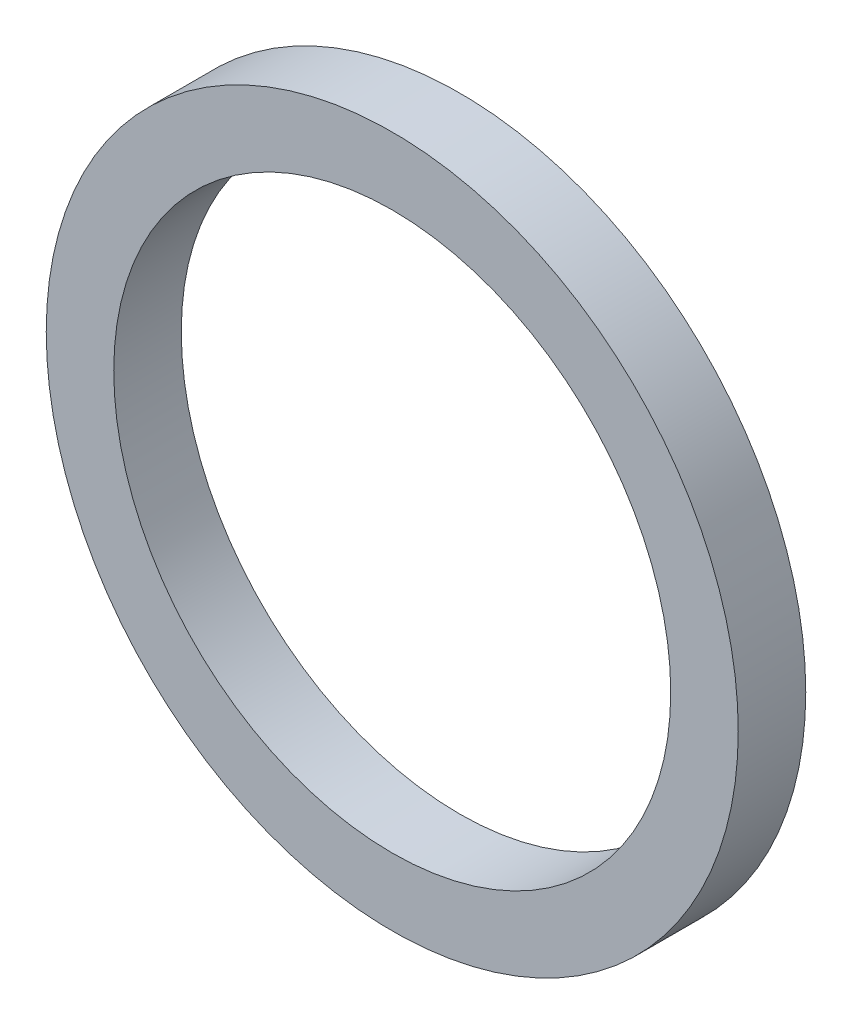
ISO-10303-21;
HEADER;
FILE_DESCRIPTION(('STEP AP214'),'2;1');
FILE_NAME('part.step','',(''),(''),'','','');
FILE_SCHEMA(('AUTOMOTIVE_DESIGN { 1 0 10303 214 1 1 1 1 }'));
ENDSEC;
DATA;
#1=APPLICATION_CONTEXT('core data for automotive mechanical design processes');
#2=APPLICATION_PROTOCOL_DEFINITION('international standard','automotive_design',2000,#1);
#3=PRODUCT_CONTEXT('',#1,'mechanical');
#4=PRODUCT('Part','Part','',(#3));
#5=PRODUCT_RELATED_PRODUCT_CATEGORY('part','',(#4));
#6=PRODUCT_DEFINITION_FORMATION('','',#4);
#7=PRODUCT_DEFINITION_CONTEXT('part definition',#1,'design');
#8=PRODUCT_DEFINITION('design','',#6,#7);
#9=PRODUCT_DEFINITION_SHAPE('','',#8);
#10=(LENGTH_UNIT() NAMED_UNIT(*) SI_UNIT(.MILLI.,.METRE.));
#11=(NAMED_UNIT(*) PLANE_ANGLE_UNIT() SI_UNIT($,.RADIAN.));
#12=(NAMED_UNIT(*) SI_UNIT($,.STERADIAN.) SOLID_ANGLE_UNIT());
#13=UNCERTAINTY_MEASURE_WITH_UNIT(LENGTH_MEASURE(1.E-05),#10,'distance_accuracy_value','');
#14=(GEOMETRIC_REPRESENTATION_CONTEXT(3) GLOBAL_UNCERTAINTY_ASSIGNED_CONTEXT((#13)) GLOBAL_UNIT_ASSIGNED_CONTEXT((#10,
#11,#12)) REPRESENTATION_CONTEXT('',''));
#15=CARTESIAN_POINT('',(0.,0.,0.));
#16=DIRECTION('',(0.,0.,1.));
#17=DIRECTION('',(1.,0.,0.));
#18=AXIS2_PLACEMENT_3D('',#15,#16,#17);
#19=CARTESIAN_POINT('',(0.,0.,2.));
#20=DIRECTION('',(0.,0.,1.));
#21=DIRECTION('',(1.,0.,0.));
#22=AXIS2_PLACEMENT_3D('',#19,#20,#21);
#23=PLANE('',#22);
#24=CARTESIAN_POINT('',(0.,0.,2.));
#25=DIRECTION('',(0.,0.,1.));
#26=DIRECTION('',(1.,0.,0.));
#27=AXIS2_PLACEMENT_3D('',#24,#25,#26);
#28=CIRCLE('',#27,10.25);
#29=CARTESIAN_POINT('',(10.25,0.,2.));
#30=VERTEX_POINT('',#29);
#31=EDGE_CURVE('E10',#30,#30,#28,.T.);
#32=ORIENTED_EDGE('',*,*,#31,.T.);
#33=EDGE_LOOP('',(#32));
#34=FACE_BOUND('',#33,.T.);
#35=CARTESIAN_POINT('',(0.,0.,2.));
#36=DIRECTION('',(0.,0.,1.));
#37=DIRECTION('',(1.,0.,0.));
#38=AXIS2_PLACEMENT_3D('',#35,#36,#37);
#39=CIRCLE('',#38,8.25);
#40=CARTESIAN_POINT('',(8.25,0.,2.));
#41=VERTEX_POINT('',#40);
#42=EDGE_CURVE('E50',#41,#41,#39,.T.);
#43=ORIENTED_EDGE('',*,*,#42,.F.);
#44=EDGE_LOOP('',(#43));
#45=FACE_BOUND('',#44,.T.);
#46=ADVANCED_FACE('F37',(#34,#45),#23,.T.);
#47=CARTESIAN_POINT('',(0.,0.,0.));
#48=DIRECTION('',(0.,0.,1.));
#49=DIRECTION('',(1.,0.,0.));
#50=AXIS2_PLACEMENT_3D('',#47,#48,#49);
#51=PLANE('',#50);
#52=CARTESIAN_POINT('',(0.,0.,0.));
#53=DIRECTION('',(0.,0.,1.));
#54=DIRECTION('',(1.,0.,0.));
#55=AXIS2_PLACEMENT_3D('',#52,#53,#54);
#56=CIRCLE('',#55,10.25);
#57=CARTESIAN_POINT('',(10.25,0.,0.));
#58=VERTEX_POINT('',#57);
#59=EDGE_CURVE('E41',#58,#58,#56,.T.);
#60=ORIENTED_EDGE('',*,*,#59,.F.);
#61=EDGE_LOOP('',(#60));
#62=FACE_BOUND('',#61,.T.);
#63=CARTESIAN_POINT('',(0.,0.,0.));
#64=DIRECTION('',(0.,0.,1.));
#65=DIRECTION('',(1.,0.,0.));
#66=AXIS2_PLACEMENT_3D('',#63,#64,#65);
#67=CIRCLE('',#66,8.25);
#68=CARTESIAN_POINT('',(8.25,0.,0.));
#69=VERTEX_POINT('',#68);
#70=EDGE_CURVE('E52',#69,#69,#67,.T.);
#71=ORIENTED_EDGE('',*,*,#70,.T.);
#72=EDGE_LOOP('',(#71));
#73=FACE_BOUND('',#72,.T.);
#74=ADVANCED_FACE('F64',(#62,#73),#51,.F.);
#75=CARTESIAN_POINT('',(0.,0.,2.));
#76=DIRECTION('',(0.,0.,-1.));
#77=DIRECTION('',(-1.,0.,0.));
#78=AXIS2_PLACEMENT_3D('',#75,#76,#77);
#79=CYLINDRICAL_SURFACE('',#78,10.25);
#80=ORIENTED_EDGE('',*,*,#31,.F.);
#81=EDGE_LOOP('',(#80));
#82=FACE_BOUND('',#81,.T.);
#83=ORIENTED_EDGE('',*,*,#59,.T.);
#84=EDGE_LOOP('',(#83));
#85=FACE_BOUND('',#84,.T.);
#86=ADVANCED_FACE('F39',(#82,#85),#79,.T.);
#87=CARTESIAN_POINT('',(0.,0.,2.));
#88=DIRECTION('',(0.,0.,-1.));
#89=DIRECTION('',(-1.,0.,0.));
#90=AXIS2_PLACEMENT_3D('',#87,#88,#89);
#91=CYLINDRICAL_SURFACE('',#90,8.25);
#92=ORIENTED_EDGE('',*,*,#42,.T.);
#93=EDGE_LOOP('',(#92));
#94=FACE_BOUND('',#93,.T.);
#95=ORIENTED_EDGE('',*,*,#70,.F.);
#96=EDGE_LOOP('',(#95));
#97=FACE_BOUND('',#96,.T.);
#98=ADVANCED_FACE('F60',(#94,#97),#91,.F.);
#99=CLOSED_SHELL('',(#46,#74,#86,#98));
#100=MANIFOLD_SOLID_BREP('B2',#99);
#101=ADVANCED_BREP_SHAPE_REPRESENTATION('',(#18,#100),#14);
#102=SHAPE_DEFINITION_REPRESENTATION(#9,#101);
ENDSEC;
END-ISO-10303-21;
